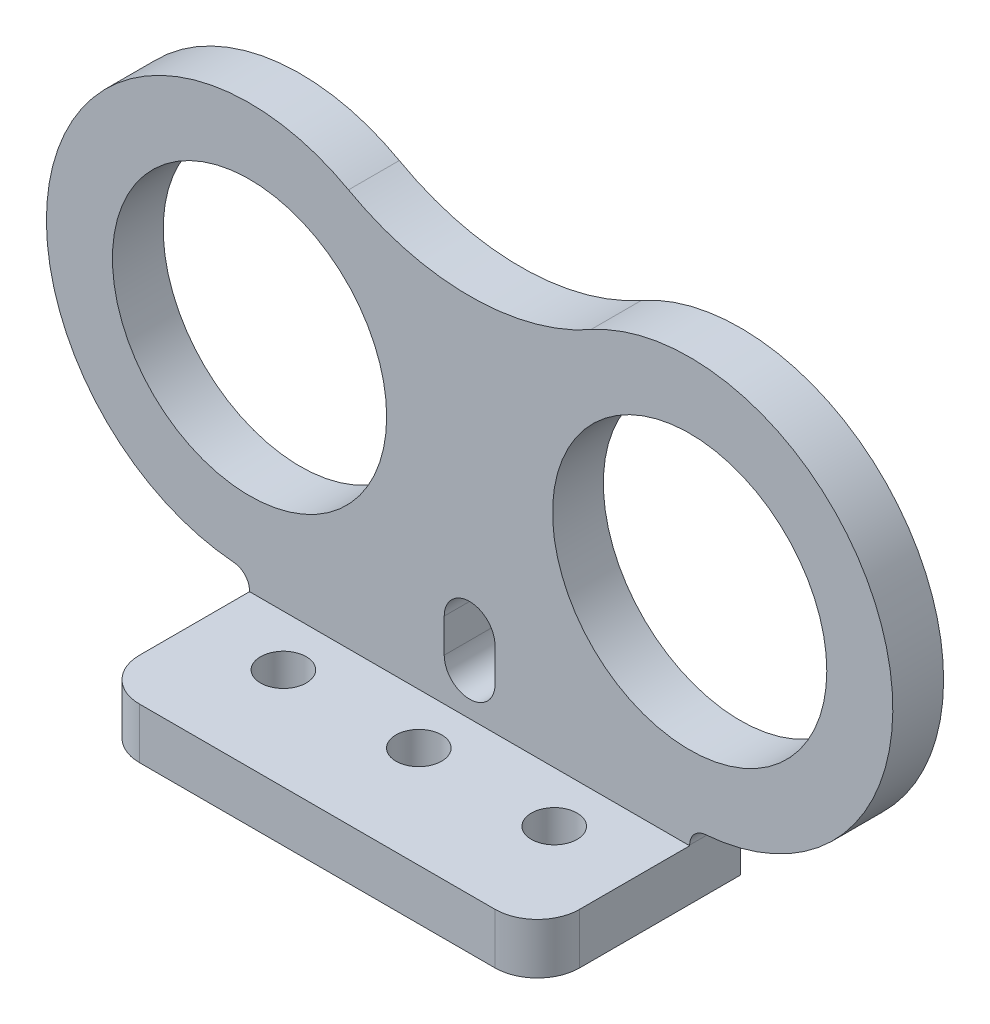
ISO-10303-21;
HEADER;
FILE_DESCRIPTION(('STEP AP214'),'2;1');
FILE_NAME('part.step','',(''),(''),'','','');
FILE_SCHEMA(('AUTOMOTIVE_DESIGN { 1 0 10303 214 1 1 1 1 }'));
ENDSEC;
DATA;
#1=APPLICATION_CONTEXT('core data for automotive mechanical design processes');
#2=APPLICATION_PROTOCOL_DEFINITION('international standard','automotive_design',2000,#1);
#3=PRODUCT_CONTEXT('',#1,'mechanical');
#4=PRODUCT('Part','Part','',(#3));
#5=PRODUCT_RELATED_PRODUCT_CATEGORY('part','',(#4));
#6=PRODUCT_DEFINITION_FORMATION('','',#4);
#7=PRODUCT_DEFINITION_CONTEXT('part definition',#1,'design');
#8=PRODUCT_DEFINITION('design','',#6,#7);
#9=PRODUCT_DEFINITION_SHAPE('','',#8);
#10=(LENGTH_UNIT() NAMED_UNIT(*) SI_UNIT(.MILLI.,.METRE.));
#11=(NAMED_UNIT(*) PLANE_ANGLE_UNIT() SI_UNIT($,.RADIAN.));
#12=(NAMED_UNIT(*) SI_UNIT($,.STERADIAN.) SOLID_ANGLE_UNIT());
#13=UNCERTAINTY_MEASURE_WITH_UNIT(LENGTH_MEASURE(1.E-05),#10,'distance_accuracy_value','');
#14=(GEOMETRIC_REPRESENTATION_CONTEXT(3) GLOBAL_UNCERTAINTY_ASSIGNED_CONTEXT((#13)) GLOBAL_UNIT_ASSIGNED_CONTEXT((#10,
#11,#12)) REPRESENTATION_CONTEXT('',''));
#15=CARTESIAN_POINT('',(0.,0.,0.));
#16=DIRECTION('',(0.,0.,1.));
#17=DIRECTION('',(1.,0.,0.));
#18=AXIS2_PLACEMENT_3D('',#15,#16,#17);
#19=CARTESIAN_POINT('',(0.,0.,3.));
#20=DIRECTION('',(0.,0.,1.));
#21=DIRECTION('',(1.,0.,0.));
#22=AXIS2_PLACEMENT_3D('',#19,#20,#21);
#23=PLANE('',#22);
#24=CARTESIAN_POINT('',(0.,5.5,3.));
#25=DIRECTION('',(0.,0.,1.));
#26=DIRECTION('',(1.,0.,0.));
#27=AXIS2_PLACEMENT_3D('',#24,#25,#26);
#28=CIRCLE('',#27,1.5);
#29=CARTESIAN_POINT('',(-1.5,5.5,3.));
#30=VERTEX_POINT('',#29);
#31=CARTESIAN_POINT('',(1.5,5.5,3.));
#32=VERTEX_POINT('',#31);
#33=EDGE_CURVE('E245',#30,#32,#28,.T.);
#34=ORIENTED_EDGE('',*,*,#33,.F.);
#35=DIRECTION('',(0.,-1.,0.));
#36=VECTOR('',#35,1.);
#37=CARTESIAN_POINT('',(-1.5,0.,3.));
#38=LINE('',#37,#36);
#39=CARTESIAN_POINT('',(-1.5,7.5,3.));
#40=VERTEX_POINT('',#39);
#41=EDGE_CURVE('E276',#40,#30,#38,.T.);
#42=ORIENTED_EDGE('',*,*,#41,.F.);
#43=CARTESIAN_POINT('',(0.,7.5,3.));
#44=DIRECTION('',(0.,0.,1.));
#45=DIRECTION('',(1.,0.,0.));
#46=AXIS2_PLACEMENT_3D('',#43,#44,#45);
#47=CIRCLE('',#46,1.5);
#48=CARTESIAN_POINT('',(1.5,7.5,3.));
#49=VERTEX_POINT('',#48);
#50=EDGE_CURVE('E285',#49,#40,#47,.T.);
#51=ORIENTED_EDGE('',*,*,#50,.F.);
#52=DIRECTION('',(0.,-1.,0.));
#53=VECTOR('',#52,1.);
#54=CARTESIAN_POINT('',(1.5,0.,3.));
#55=LINE('',#54,#53);
#56=EDGE_CURVE('E287',#49,#32,#55,.T.);
#57=ORIENTED_EDGE('',*,*,#56,.T.);
#58=EDGE_LOOP('',(#34,#42,#51,#57));
#59=FACE_BOUND('',#58,.T.);
#60=CARTESIAN_POINT('',(13.,16.,3.));
#61=DIRECTION('',(0.,0.,1.));
#62=DIRECTION('',(1.,0.,0.));
#63=AXIS2_PLACEMENT_3D('',#60,#61,#62);
#64=CIRCLE('',#63,8.10000000000002);
#65=CARTESIAN_POINT('',(21.1,16.,3.));
#66=VERTEX_POINT('',#65);
#67=EDGE_CURVE('E183',#66,#66,#64,.T.);
#68=ORIENTED_EDGE('',*,*,#67,.F.);
#69=EDGE_LOOP('',(#68));
#70=FACE_BOUND('',#69,.T.);
#71=CARTESIAN_POINT('',(-13.,16.,3.));
#72=DIRECTION('',(0.,0.,1.));
#73=DIRECTION('',(1.,0.,0.));
#74=AXIS2_PLACEMENT_3D('',#71,#72,#73);
#75=CIRCLE('',#74,8.10000000000002);
#76=CARTESIAN_POINT('',(-4.89999999999998,16.,3.));
#77=VERTEX_POINT('',#76);
#78=EDGE_CURVE('E187',#77,#77,#75,.F.);
#79=ORIENTED_EDGE('',*,*,#78,.T.);
#80=EDGE_LOOP('',(#79));
#81=FACE_BOUND('',#80,.T.);
#82=DIRECTION('',(0.,-1.,0.));
#83=VECTOR('',#82,1.);
#84=CARTESIAN_POINT('',(-13.,0.,3.));
#85=LINE('',#84,#83);
#86=CARTESIAN_POINT('',(-13.,3.03851860318428,3.));
#87=VERTEX_POINT('',#86);
#88=CARTESIAN_POINT('',(-13.,3.,3.));
#89=VERTEX_POINT('',#88);
#90=EDGE_CURVE('E165',#87,#89,#85,.T.);
#91=ORIENTED_EDGE('',*,*,#90,.T.);
#92=DIRECTION('',(1.,0.,0.));
#93=VECTOR('',#92,1.);
#94=CARTESIAN_POINT('',(-13.,3.,3.));
#95=LINE('',#94,#93);
#96=CARTESIAN_POINT('',(13.,3.,3.));
#97=VERTEX_POINT('',#96);
#98=EDGE_CURVE('E320',#89,#97,#95,.T.);
#99=ORIENTED_EDGE('',*,*,#98,.T.);
#100=DIRECTION('',(0.,-1.,0.));
#101=VECTOR('',#100,1.);
#102=CARTESIAN_POINT('',(13.,0.,3.));
#103=LINE('',#102,#101);
#104=CARTESIAN_POINT('',(13.,3.03851860318428,3.));
#105=VERTEX_POINT('',#104);
#106=EDGE_CURVE('E180',#105,#97,#103,.T.);
#107=ORIENTED_EDGE('',*,*,#106,.F.);
#108=CARTESIAN_POINT('',(14.,3.03851860318428,3.));
#109=DIRECTION('',(0.,0.,1.));
#110=DIRECTION('',(1.,0.,0.));
#111=AXIS2_PLACEMENT_3D('',#108,#109,#110);
#112=CIRCLE('',#111,1.);
#113=CARTESIAN_POINT('',(13.9230769230769,4.03555563370856,3.));
#114=VERTEX_POINT('',#113);
#115=EDGE_CURVE('E291',#114,#105,#112,.T.);
#116=ORIENTED_EDGE('',*,*,#115,.F.);
#117=CARTESIAN_POINT('',(13.,16.,3.));
#118=DIRECTION('',(0.,0.,1.));
#119=DIRECTION('',(1.,0.,0.));
#120=AXIS2_PLACEMENT_3D('',#117,#118,#119);
#121=CIRCLE('',#120,12.);
#122=CARTESIAN_POINT('',(7.1533537155293,26.4793476526111,3.));
#123=VERTEX_POINT('',#122);
#124=EDGE_CURVE('E174',#123,#114,#121,.F.);
#125=ORIENTED_EDGE('',*,*,#124,.F.);
#126=CARTESIAN_POINT('',(0.,39.3007972187045,3.));
#127=DIRECTION('',(0.,0.,1.));
#128=DIRECTION('',(1.,0.,0.));
#129=AXIS2_PLACEMENT_3D('',#126,#127,#128);
#130=CIRCLE('',#129,14.681963027993);
#131=CARTESIAN_POINT('',(-7.1533537155293,26.4793476526111,3.));
#132=VERTEX_POINT('',#131);
#133=EDGE_CURVE('E170',#132,#123,#130,.T.);
#134=ORIENTED_EDGE('',*,*,#133,.F.);
#135=CARTESIAN_POINT('',(-13.,16.,3.));
#136=DIRECTION('',(0.,0.,1.));
#137=DIRECTION('',(1.,0.,0.));
#138=AXIS2_PLACEMENT_3D('',#135,#136,#137);
#139=CIRCLE('',#138,12.);
#140=CARTESIAN_POINT('',(-13.9230769230769,4.03555563370856,3.));
#141=VERTEX_POINT('',#140);
#142=EDGE_CURVE('E147',#141,#132,#139,.F.);
#143=ORIENTED_EDGE('',*,*,#142,.F.);
#144=CARTESIAN_POINT('',(-14.,3.03851860318428,3.));
#145=DIRECTION('',(0.,0.,1.));
#146=DIRECTION('',(1.,0.,0.));
#147=AXIS2_PLACEMENT_3D('',#144,#145,#146);
#148=CIRCLE('',#147,1.);
#149=EDGE_CURVE('E159',#141,#87,#148,.F.);
#150=ORIENTED_EDGE('',*,*,#149,.T.);
#151=EDGE_LOOP('',(#91,#99,#107,#116,#125,#134,#143,#150));
#152=FACE_BOUND('',#151,.T.);
#153=ADVANCED_FACE('F41',(#59,#70,#81,#152),#23,.T.);
#154=CARTESIAN_POINT('',(14.,3.03851860318428,3.));
#155=DIRECTION('',(0.,0.,-1.));
#156=DIRECTION('',(-1.,0.,0.));
#157=AXIS2_PLACEMENT_3D('',#154,#155,#156);
#158=CYLINDRICAL_SURFACE('',#157,1.);
#159=CARTESIAN_POINT('',(14.,3.03851860318428,0.));
#160=DIRECTION('',(0.,0.,1.));
#161=DIRECTION('',(1.,0.,0.));
#162=AXIS2_PLACEMENT_3D('',#159,#160,#161);
#163=CIRCLE('',#162,1.);
#164=CARTESIAN_POINT('',(13.9230769230769,4.03555563370856,0.));
#165=VERTEX_POINT('',#164);
#166=CARTESIAN_POINT('',(13.,3.03851860318428,0.));
#167=VERTEX_POINT('',#166);
#168=EDGE_CURVE('E209',#165,#167,#163,.T.);
#169=ORIENTED_EDGE('',*,*,#168,.F.);
#170=DIRECTION('',(0.,0.,-1.));
#171=VECTOR('',#170,1.);
#172=CARTESIAN_POINT('',(13.9230769230769,4.03555563370856,3.));
#173=LINE('',#172,#171);
#174=EDGE_CURVE('E11',#114,#165,#173,.T.);
#175=ORIENTED_EDGE('',*,*,#174,.F.);
#176=ORIENTED_EDGE('',*,*,#115,.T.);
#177=DIRECTION('',(0.,0.,-1.));
#178=VECTOR('',#177,1.);
#179=CARTESIAN_POINT('',(13.,3.03851860318428,3.));
#180=LINE('',#179,#178);
#181=EDGE_CURVE('E68',#105,#167,#180,.T.);
#182=ORIENTED_EDGE('',*,*,#181,.T.);
#183=EDGE_LOOP('',(#169,#175,#176,#182));
#184=FACE_BOUND('',#183,.T.);
#185=ADVANCED_FACE('F453',(#184),#158,.F.);
#186=CARTESIAN_POINT('',(13.,16.,3.));
#187=DIRECTION('',(0.,0.,-1.));
#188=DIRECTION('',(-1.,0.,0.));
#189=AXIS2_PLACEMENT_3D('',#186,#187,#188);
#190=CYLINDRICAL_SURFACE('',#189,12.);
#191=CARTESIAN_POINT('',(13.,16.,0.));
#192=DIRECTION('',(0.,0.,1.));
#193=DIRECTION('',(1.,0.,0.));
#194=AXIS2_PLACEMENT_3D('',#191,#192,#193);
#195=CIRCLE('',#194,12.);
#196=CARTESIAN_POINT('',(7.1533537155293,26.4793476526111,0.));
#197=VERTEX_POINT('',#196);
#198=EDGE_CURVE('E212',#197,#165,#195,.F.);
#199=ORIENTED_EDGE('',*,*,#198,.F.);
#200=DIRECTION('',(0.,0.,-1.));
#201=VECTOR('',#200,1.);
#202=CARTESIAN_POINT('',(7.1533537155293,26.4793476526111,3.));
#203=LINE('',#202,#201);
#204=EDGE_CURVE('E51',#123,#197,#203,.T.);
#205=ORIENTED_EDGE('',*,*,#204,.F.);
#206=ORIENTED_EDGE('',*,*,#124,.T.);
#207=ORIENTED_EDGE('',*,*,#174,.T.);
#208=EDGE_LOOP('',(#199,#205,#206,#207));
#209=FACE_BOUND('',#208,.T.);
#210=ADVANCED_FACE('F305',(#209),#190,.T.);
#211=CARTESIAN_POINT('',(0.,39.3007972187045,3.));
#212=DIRECTION('',(0.,0.,-1.));
#213=DIRECTION('',(-1.,0.,0.));
#214=AXIS2_PLACEMENT_3D('',#211,#212,#213);
#215=CYLINDRICAL_SURFACE('',#214,14.681963027993);
#216=CARTESIAN_POINT('',(0.,39.3007972187045,0.));
#217=DIRECTION('',(0.,0.,1.));
#218=DIRECTION('',(1.,0.,0.));
#219=AXIS2_PLACEMENT_3D('',#216,#217,#218);
#220=CIRCLE('',#219,14.681963027993);
#221=CARTESIAN_POINT('',(-7.1533537155293,26.4793476526111,0.));
#222=VERTEX_POINT('',#221);
#223=EDGE_CURVE('E216',#222,#197,#220,.T.);
#224=ORIENTED_EDGE('',*,*,#223,.F.);
#225=DIRECTION('',(0.,0.,-1.));
#226=VECTOR('',#225,1.);
#227=CARTESIAN_POINT('',(-7.1533537155293,26.4793476526111,3.));
#228=LINE('',#227,#226);
#229=EDGE_CURVE('E154',#132,#222,#228,.T.);
#230=ORIENTED_EDGE('',*,*,#229,.F.);
#231=ORIENTED_EDGE('',*,*,#133,.T.);
#232=ORIENTED_EDGE('',*,*,#204,.T.);
#233=EDGE_LOOP('',(#224,#230,#231,#232));
#234=FACE_BOUND('',#233,.T.);
#235=ADVANCED_FACE('F310',(#234),#215,.F.);
#236=CARTESIAN_POINT('',(-13.,16.,3.));
#237=DIRECTION('',(0.,0.,-1.));
#238=DIRECTION('',(-1.,0.,0.));
#239=AXIS2_PLACEMENT_3D('',#236,#237,#238);
#240=CYLINDRICAL_SURFACE('',#239,12.);
#241=CARTESIAN_POINT('',(-13.,16.,0.));
#242=DIRECTION('',(0.,0.,1.));
#243=DIRECTION('',(1.,0.,0.));
#244=AXIS2_PLACEMENT_3D('',#241,#242,#243);
#245=CIRCLE('',#244,12.);
#246=CARTESIAN_POINT('',(-13.9230769230769,4.03555563370856,0.));
#247=VERTEX_POINT('',#246);
#248=EDGE_CURVE('E149',#247,#222,#245,.F.);
#249=ORIENTED_EDGE('',*,*,#248,.F.);
#250=DIRECTION('',(0.,0.,-1.));
#251=VECTOR('',#250,1.);
#252=CARTESIAN_POINT('',(-13.9230769230769,4.03555563370856,3.));
#253=LINE('',#252,#251);
#254=EDGE_CURVE('E143',#141,#247,#253,.T.);
#255=ORIENTED_EDGE('',*,*,#254,.F.);
#256=ORIENTED_EDGE('',*,*,#142,.T.);
#257=ORIENTED_EDGE('',*,*,#229,.T.);
#258=EDGE_LOOP('',(#249,#255,#256,#257));
#259=FACE_BOUND('',#258,.T.);
#260=ADVANCED_FACE('F145',(#259),#240,.T.);
#261=CARTESIAN_POINT('',(-14.,3.03851860318428,3.));
#262=DIRECTION('',(0.,0.,-1.));
#263=DIRECTION('',(-1.,0.,0.));
#264=AXIS2_PLACEMENT_3D('',#261,#262,#263);
#265=CYLINDRICAL_SURFACE('',#264,1.);
#266=CARTESIAN_POINT('',(-14.,3.03851860318428,0.));
#267=DIRECTION('',(0.,0.,1.));
#268=DIRECTION('',(1.,0.,0.));
#269=AXIS2_PLACEMENT_3D('',#266,#267,#268);
#270=CIRCLE('',#269,1.);
#271=CARTESIAN_POINT('',(-13.,3.03851860318428,0.));
#272=VERTEX_POINT('',#271);
#273=EDGE_CURVE('E222',#247,#272,#270,.F.);
#274=ORIENTED_EDGE('',*,*,#273,.T.);
#275=DIRECTION('',(0.,0.,-1.));
#276=VECTOR('',#275,1.);
#277=CARTESIAN_POINT('',(-13.,3.03851860318428,3.));
#278=LINE('',#277,#276);
#279=EDGE_CURVE('E155',#87,#272,#278,.T.);
#280=ORIENTED_EDGE('',*,*,#279,.F.);
#281=ORIENTED_EDGE('',*,*,#149,.F.);
#282=ORIENTED_EDGE('',*,*,#254,.T.);
#283=EDGE_LOOP('',(#274,#280,#281,#282));
#284=FACE_BOUND('',#283,.T.);
#285=ADVANCED_FACE('F160',(#284),#265,.F.);
#286=CARTESIAN_POINT('',(-13.,0.,3.));
#287=DIRECTION('',(1.,0.,0.));
#288=DIRECTION('',(0.,0.,-1.));
#289=AXIS2_PLACEMENT_3D('',#286,#287,#288);
#290=PLANE('',#289);
#291=DIRECTION('',(0.,-1.,0.));
#292=VECTOR('',#291,1.);
#293=CARTESIAN_POINT('',(-13.,0.,0.));
#294=LINE('',#293,#292);
#295=CARTESIAN_POINT('',(-13.,0.,0.));
#296=VERTEX_POINT('',#295);
#297=EDGE_CURVE('E225',#272,#296,#294,.T.);
#298=ORIENTED_EDGE('',*,*,#297,.T.);
#299=DIRECTION('',(0.,0.,-1.));
#300=VECTOR('',#299,1.);
#301=CARTESIAN_POINT('',(-13.,0.,3.));
#302=LINE('',#301,#300);
#303=CARTESIAN_POINT('',(-13.,0.,9.49999999999998));
#304=VERTEX_POINT('',#303);
#305=EDGE_CURVE('E251',#304,#296,#302,.T.);
#306=ORIENTED_EDGE('',*,*,#305,.F.);
#307=DIRECTION('',(0.,-1.,0.));
#308=VECTOR('',#307,1.);
#309=CARTESIAN_POINT('',(-13.,3.,9.49999999999998));
#310=LINE('',#309,#308);
#311=CARTESIAN_POINT('',(-13.,3.,9.49999999999998));
#312=VERTEX_POINT('',#311);
#313=EDGE_CURVE('E197',#312,#304,#310,.T.);
#314=ORIENTED_EDGE('',*,*,#313,.F.);
#315=DIRECTION('',(0.,0.,-1.));
#316=VECTOR('',#315,1.);
#317=CARTESIAN_POINT('',(-13.,3.,3.));
#318=LINE('',#317,#316);
#319=EDGE_CURVE('E319',#312,#89,#318,.T.);
#320=ORIENTED_EDGE('',*,*,#319,.T.);
#321=ORIENTED_EDGE('',*,*,#90,.F.);
#322=ORIENTED_EDGE('',*,*,#279,.T.);
#323=EDGE_LOOP('',(#298,#306,#314,#320,#321,#322));
#324=FACE_BOUND('',#323,.T.);
#325=ADVANCED_FACE('F314',(#324),#290,.F.);
#326=CARTESIAN_POINT('',(0.,0.,3.));
#327=DIRECTION('',(0.,1.,0.));
#328=DIRECTION('',(-1.,0.,0.));
#329=AXIS2_PLACEMENT_3D('',#326,#327,#328);
#330=PLANE('',#329);
#331=DIRECTION('',(1.,0.,0.));
#332=VECTOR('',#331,1.);
#333=CARTESIAN_POINT('',(0.,0.,0.));
#334=LINE('',#333,#332);
#335=CARTESIAN_POINT('',(13.,0.,0.));
#336=VERTEX_POINT('',#335);
#337=EDGE_CURVE('E229',#296,#336,#334,.T.);
#338=ORIENTED_EDGE('',*,*,#337,.T.);
#339=DIRECTION('',(0.,0.,-1.));
#340=VECTOR('',#339,1.);
#341=CARTESIAN_POINT('',(13.,0.,3.));
#342=LINE('',#341,#340);
#343=CARTESIAN_POINT('',(13.,0.,9.49999999999998));
#344=VERTEX_POINT('',#343);
#345=EDGE_CURVE('E248',#344,#336,#342,.T.);
#346=ORIENTED_EDGE('',*,*,#345,.F.);
#347=CARTESIAN_POINT('',(10.5,0.,9.5));
#348=DIRECTION('',(0.,-1.,0.));
#349=DIRECTION('',(-1.,0.,0.));
#350=AXIS2_PLACEMENT_3D('',#347,#348,#349);
#351=CIRCLE('',#350,2.5);
#352=CARTESIAN_POINT('',(10.5,0.,12.));
#353=VERTEX_POINT('',#352);
#354=EDGE_CURVE('E363',#344,#353,#351,.T.);
#355=ORIENTED_EDGE('',*,*,#354,.T.);
#356=DIRECTION('',(-1.,0.,0.));
#357=VECTOR('',#356,1.);
#358=CARTESIAN_POINT('',(-10.5,0.,12.));
#359=LINE('',#358,#357);
#360=CARTESIAN_POINT('',(-10.5,0.,12.));
#361=VERTEX_POINT('',#360);
#362=EDGE_CURVE('E346',#353,#361,#359,.T.);
#363=ORIENTED_EDGE('',*,*,#362,.T.);
#364=CARTESIAN_POINT('',(-10.5,0.,9.5));
#365=DIRECTION('',(0.,-1.,0.));
#366=DIRECTION('',(-1.,0.,0.));
#367=AXIS2_PLACEMENT_3D('',#364,#365,#366);
#368=CIRCLE('',#367,2.5);
#369=EDGE_CURVE('E361',#361,#304,#368,.T.);
#370=ORIENTED_EDGE('',*,*,#369,.T.);
#371=ORIENTED_EDGE('',*,*,#305,.T.);
#372=EDGE_LOOP('',(#338,#346,#355,#363,#370,#371));
#373=FACE_BOUND('',#372,.T.);
#374=CARTESIAN_POINT('',(0.,0.,6.));
#375=DIRECTION('',(0.,-1.,0.));
#376=DIRECTION('',(1.,0.,0.));
#377=AXIS2_PLACEMENT_3D('',#374,#375,#376);
#378=CIRCLE('',#377,1.35);
#379=CARTESIAN_POINT('',(1.35,0.,6.));
#380=VERTEX_POINT('',#379);
#381=EDGE_CURVE('E416',#380,#380,#378,.T.);
#382=ORIENTED_EDGE('',*,*,#381,.F.);
#383=EDGE_LOOP('',(#382));
#384=FACE_BOUND('',#383,.T.);
#385=CARTESIAN_POINT('',(-8.,0.,6.));
#386=DIRECTION('',(0.,-1.,0.));
#387=DIRECTION('',(-1.,0.,0.));
#388=AXIS2_PLACEMENT_3D('',#385,#386,#387);
#389=CIRCLE('',#388,1.35);
#390=CARTESIAN_POINT('',(-9.35,0.,6.));
#391=VERTEX_POINT('',#390);
#392=EDGE_CURVE('E408',#391,#391,#389,.T.);
#393=ORIENTED_EDGE('',*,*,#392,.F.);
#394=EDGE_LOOP('',(#393));
#395=FACE_BOUND('',#394,.T.);
#396=CARTESIAN_POINT('',(8.,0.,6.));
#397=DIRECTION('',(0.,-1.,0.));
#398=DIRECTION('',(1.,0.,0.));
#399=AXIS2_PLACEMENT_3D('',#396,#397,#398);
#400=CIRCLE('',#399,1.35);
#401=CARTESIAN_POINT('',(9.35,0.,6.));
#402=VERTEX_POINT('',#401);
#403=EDGE_CURVE('E400',#402,#402,#400,.T.);
#404=ORIENTED_EDGE('',*,*,#403,.F.);
#405=EDGE_LOOP('',(#404));
#406=FACE_BOUND('',#405,.T.);
#407=ADVANCED_FACE('F359',(#373,#384,#395,#406),#330,.F.);
#408=CARTESIAN_POINT('',(0.,5.5,3.));
#409=DIRECTION('',(0.,0.,-1.));
#410=DIRECTION('',(-1.,0.,0.));
#411=AXIS2_PLACEMENT_3D('',#408,#409,#410);
#412=CYLINDRICAL_SURFACE('',#411,1.5);
#413=CARTESIAN_POINT('',(0.,5.5,0.));
#414=DIRECTION('',(0.,0.,1.));
#415=DIRECTION('',(1.,0.,0.));
#416=AXIS2_PLACEMENT_3D('',#413,#414,#415);
#417=CIRCLE('',#416,1.5);
#418=CARTESIAN_POINT('',(-1.5,5.5,0.));
#419=VERTEX_POINT('',#418);
#420=CARTESIAN_POINT('',(1.5,5.5,0.));
#421=VERTEX_POINT('',#420);
#422=EDGE_CURVE('E192',#419,#421,#417,.T.);
#423=ORIENTED_EDGE('',*,*,#422,.F.);
#424=DIRECTION('',(0.,0.,-1.));
#425=VECTOR('',#424,1.);
#426=CARTESIAN_POINT('',(-1.5,5.5,3.));
#427=LINE('',#426,#425);
#428=EDGE_CURVE('E45',#30,#419,#427,.T.);
#429=ORIENTED_EDGE('',*,*,#428,.F.);
#430=ORIENTED_EDGE('',*,*,#33,.T.);
#431=DIRECTION('',(0.,0.,-1.));
#432=VECTOR('',#431,1.);
#433=CARTESIAN_POINT('',(1.5,5.5,3.));
#434=LINE('',#433,#432);
#435=EDGE_CURVE('E191',#32,#421,#434,.T.);
#436=ORIENTED_EDGE('',*,*,#435,.T.);
#437=EDGE_LOOP('',(#423,#429,#430,#436));
#438=FACE_BOUND('',#437,.T.);
#439=ADVANCED_FACE('F43',(#438),#412,.F.);
#440=CARTESIAN_POINT('',(-1.5,0.,3.));
#441=DIRECTION('',(1.,0.,0.));
#442=DIRECTION('',(0.,1.,0.));
#443=AXIS2_PLACEMENT_3D('',#440,#441,#442);
#444=PLANE('',#443);
#445=DIRECTION('',(0.,-1.,0.));
#446=VECTOR('',#445,1.);
#447=CARTESIAN_POINT('',(-1.5,0.,0.));
#448=LINE('',#447,#446);
#449=CARTESIAN_POINT('',(-1.5,7.5,0.));
#450=VERTEX_POINT('',#449);
#451=EDGE_CURVE('E196',#450,#419,#448,.T.);
#452=ORIENTED_EDGE('',*,*,#451,.F.);
#453=DIRECTION('',(0.,0.,-1.));
#454=VECTOR('',#453,1.);
#455=CARTESIAN_POINT('',(-1.5,7.5,3.));
#456=LINE('',#455,#454);
#457=EDGE_CURVE('E265',#40,#450,#456,.T.);
#458=ORIENTED_EDGE('',*,*,#457,.F.);
#459=ORIENTED_EDGE('',*,*,#41,.T.);
#460=ORIENTED_EDGE('',*,*,#428,.T.);
#461=EDGE_LOOP('',(#452,#458,#459,#460));
#462=FACE_BOUND('',#461,.T.);
#463=ADVANCED_FACE('F274',(#462),#444,.T.);
#464=CARTESIAN_POINT('',(0.,7.5,3.));
#465=DIRECTION('',(0.,0.,-1.));
#466=DIRECTION('',(-1.,0.,0.));
#467=AXIS2_PLACEMENT_3D('',#464,#465,#466);
#468=CYLINDRICAL_SURFACE('',#467,1.5);
#469=CARTESIAN_POINT('',(0.,7.5,0.));
#470=DIRECTION('',(0.,0.,1.));
#471=DIRECTION('',(1.,0.,0.));
#472=AXIS2_PLACEMENT_3D('',#469,#470,#471);
#473=CIRCLE('',#472,1.5);
#474=CARTESIAN_POINT('',(1.5,7.5,0.));
#475=VERTEX_POINT('',#474);
#476=EDGE_CURVE('E201',#475,#450,#473,.T.);
#477=ORIENTED_EDGE('',*,*,#476,.F.);
#478=DIRECTION('',(0.,0.,-1.));
#479=VECTOR('',#478,1.);
#480=CARTESIAN_POINT('',(1.5,7.5,3.));
#481=LINE('',#480,#479);
#482=EDGE_CURVE('E263',#49,#475,#481,.T.);
#483=ORIENTED_EDGE('',*,*,#482,.F.);
#484=ORIENTED_EDGE('',*,*,#50,.T.);
#485=ORIENTED_EDGE('',*,*,#457,.T.);
#486=EDGE_LOOP('',(#477,#483,#484,#485));
#487=FACE_BOUND('',#486,.T.);
#488=ADVANCED_FACE('F282',(#487),#468,.F.);
#489=CARTESIAN_POINT('',(13.,16.,3.));
#490=DIRECTION('',(0.,0.,-1.));
#491=DIRECTION('',(-1.,0.,0.));
#492=AXIS2_PLACEMENT_3D('',#489,#490,#491);
#493=CYLINDRICAL_SURFACE('',#492,8.10000000000002);
#494=ORIENTED_EDGE('',*,*,#67,.T.);
#495=EDGE_LOOP('',(#494));
#496=FACE_BOUND('',#495,.T.);
#497=CARTESIAN_POINT('',(13.,16.,0.));
#498=DIRECTION('',(0.,0.,1.));
#499=DIRECTION('',(1.,0.,0.));
#500=AXIS2_PLACEMENT_3D('',#497,#498,#499);
#501=CIRCLE('',#500,8.10000000000002);
#502=CARTESIAN_POINT('',(21.1,16.,0.));
#503=VERTEX_POINT('',#502);
#504=EDGE_CURVE('E237',#503,#503,#501,.T.);
#505=ORIENTED_EDGE('',*,*,#504,.F.);
#506=EDGE_LOOP('',(#505));
#507=FACE_BOUND('',#506,.T.);
#508=ADVANCED_FACE('F468',(#496,#507),#493,.F.);
#509=CARTESIAN_POINT('',(13.,0.,3.));
#510=DIRECTION('',(1.,0.,0.));
#511=DIRECTION('',(0.,0.,-1.));
#512=AXIS2_PLACEMENT_3D('',#509,#510,#511);
#513=PLANE('',#512);
#514=DIRECTION('',(0.,-1.,0.));
#515=VECTOR('',#514,1.);
#516=CARTESIAN_POINT('',(13.,0.,0.));
#517=LINE('',#516,#515);
#518=EDGE_CURVE('E233',#167,#336,#517,.T.);
#519=ORIENTED_EDGE('',*,*,#518,.F.);
#520=ORIENTED_EDGE('',*,*,#181,.F.);
#521=ORIENTED_EDGE('',*,*,#106,.T.);
#522=DIRECTION('',(0.,0.,1.));
#523=VECTOR('',#522,1.);
#524=CARTESIAN_POINT('',(13.,3.,3.));
#525=LINE('',#524,#523);
#526=CARTESIAN_POINT('',(13.,3.,9.49999999999998));
#527=VERTEX_POINT('',#526);
#528=EDGE_CURVE('E59',#97,#527,#525,.T.);
#529=ORIENTED_EDGE('',*,*,#528,.T.);
#530=DIRECTION('',(0.,-1.,0.));
#531=VECTOR('',#530,1.);
#532=CARTESIAN_POINT('',(13.,3.,9.49999999999998));
#533=LINE('',#532,#531);
#534=EDGE_CURVE('E378',#527,#344,#533,.T.);
#535=ORIENTED_EDGE('',*,*,#534,.T.);
#536=ORIENTED_EDGE('',*,*,#345,.T.);
#537=EDGE_LOOP('',(#519,#520,#521,#529,#535,#536));
#538=FACE_BOUND('',#537,.T.);
#539=ADVANCED_FACE('F471',(#538),#513,.T.);
#540=CARTESIAN_POINT('',(1.5,0.,3.));
#541=DIRECTION('',(1.,0.,0.));
#542=DIRECTION('',(0.,1.,0.));
#543=AXIS2_PLACEMENT_3D('',#540,#541,#542);
#544=PLANE('',#543);
#545=DIRECTION('',(0.,-1.,0.));
#546=VECTOR('',#545,1.);
#547=CARTESIAN_POINT('',(1.5,0.,0.));
#548=LINE('',#547,#546);
#549=EDGE_CURVE('E205',#475,#421,#548,.T.);
#550=ORIENTED_EDGE('',*,*,#549,.T.);
#551=ORIENTED_EDGE('',*,*,#435,.F.);
#552=ORIENTED_EDGE('',*,*,#56,.F.);
#553=ORIENTED_EDGE('',*,*,#482,.T.);
#554=EDGE_LOOP('',(#550,#551,#552,#553));
#555=FACE_BOUND('',#554,.T.);
#556=ADVANCED_FACE('F288',(#555),#544,.F.);
#557=CARTESIAN_POINT('',(-13.,16.,3.));
#558=DIRECTION('',(0.,0.,-1.));
#559=DIRECTION('',(-1.,0.,0.));
#560=AXIS2_PLACEMENT_3D('',#557,#558,#559);
#561=CYLINDRICAL_SURFACE('',#560,8.10000000000002);
#562=ORIENTED_EDGE('',*,*,#78,.F.);
#563=EDGE_LOOP('',(#562));
#564=FACE_BOUND('',#563,.T.);
#565=CARTESIAN_POINT('',(-13.,16.,0.));
#566=DIRECTION('',(0.,0.,1.));
#567=DIRECTION('',(1.,0.,0.));
#568=AXIS2_PLACEMENT_3D('',#565,#566,#567);
#569=CIRCLE('',#568,8.10000000000002);
#570=CARTESIAN_POINT('',(-4.89999999999998,16.,0.));
#571=VERTEX_POINT('',#570);
#572=EDGE_CURVE('E241',#571,#571,#569,.F.);
#573=ORIENTED_EDGE('',*,*,#572,.T.);
#574=EDGE_LOOP('',(#573));
#575=FACE_BOUND('',#574,.T.);
#576=ADVANCED_FACE('F464',(#564,#575),#561,.F.);
#577=CARTESIAN_POINT('',(0.,0.,0.));
#578=DIRECTION('',(0.,0.,1.));
#579=DIRECTION('',(1.,0.,0.));
#580=AXIS2_PLACEMENT_3D('',#577,#578,#579);
#581=PLANE('',#580);
#582=ORIENTED_EDGE('',*,*,#422,.T.);
#583=ORIENTED_EDGE('',*,*,#549,.F.);
#584=ORIENTED_EDGE('',*,*,#476,.T.);
#585=ORIENTED_EDGE('',*,*,#451,.T.);
#586=EDGE_LOOP('',(#582,#583,#584,#585));
#587=FACE_BOUND('',#586,.T.);
#588=ORIENTED_EDGE('',*,*,#168,.T.);
#589=ORIENTED_EDGE('',*,*,#518,.T.);
#590=ORIENTED_EDGE('',*,*,#337,.F.);
#591=ORIENTED_EDGE('',*,*,#297,.F.);
#592=ORIENTED_EDGE('',*,*,#273,.F.);
#593=ORIENTED_EDGE('',*,*,#248,.T.);
#594=ORIENTED_EDGE('',*,*,#223,.T.);
#595=ORIENTED_EDGE('',*,*,#198,.T.);
#596=EDGE_LOOP('',(#588,#589,#590,#591,#592,#593,#594,#595));
#597=FACE_BOUND('',#596,.T.);
#598=ORIENTED_EDGE('',*,*,#504,.T.);
#599=EDGE_LOOP('',(#598));
#600=FACE_BOUND('',#599,.T.);
#601=ORIENTED_EDGE('',*,*,#572,.F.);
#602=EDGE_LOOP('',(#601));
#603=FACE_BOUND('',#602,.T.);
#604=ADVANCED_FACE('F280',(#587,#597,#600,#603),#581,.F.);
#605=CARTESIAN_POINT('',(-10.5,3.,9.5));
#606=DIRECTION('',(0.,-1.,0.));
#607=DIRECTION('',(1.,0.,0.));
#608=AXIS2_PLACEMENT_3D('',#605,#606,#607);
#609=CYLINDRICAL_SURFACE('',#608,2.5);
#610=ORIENTED_EDGE('',*,*,#369,.F.);
#611=DIRECTION('',(0.,-1.,0.));
#612=VECTOR('',#611,1.);
#613=CARTESIAN_POINT('',(-10.5,3.,12.));
#614=LINE('',#613,#612);
#615=CARTESIAN_POINT('',(-10.5,3.,12.));
#616=VERTEX_POINT('',#615);
#617=EDGE_CURVE('E343',#616,#361,#614,.T.);
#618=ORIENTED_EDGE('',*,*,#617,.F.);
#619=CARTESIAN_POINT('',(-10.5,3.,9.5));
#620=DIRECTION('',(0.,-1.,0.));
#621=DIRECTION('',(-1.,0.,0.));
#622=AXIS2_PLACEMENT_3D('',#619,#620,#621);
#623=CIRCLE('',#622,2.5);
#624=EDGE_CURVE('E381',#616,#312,#623,.T.);
#625=ORIENTED_EDGE('',*,*,#624,.T.);
#626=ORIENTED_EDGE('',*,*,#313,.T.);
#627=EDGE_LOOP('',(#610,#618,#625,#626));
#628=FACE_BOUND('',#627,.T.);
#629=ADVANCED_FACE('F367',(#628),#609,.T.);
#630=CARTESIAN_POINT('',(-10.5,3.,12.));
#631=DIRECTION('',(0.,0.,1.));
#632=DIRECTION('',(1.,0.,0.));
#633=AXIS2_PLACEMENT_3D('',#630,#631,#632);
#634=PLANE('',#633);
#635=ORIENTED_EDGE('',*,*,#362,.F.);
#636=DIRECTION('',(0.,-1.,0.));
#637=VECTOR('',#636,1.);
#638=CARTESIAN_POINT('',(10.5,3.,12.));
#639=LINE('',#638,#637);
#640=CARTESIAN_POINT('',(10.5,3.,12.));
#641=VERTEX_POINT('',#640);
#642=EDGE_CURVE('E355',#641,#353,#639,.T.);
#643=ORIENTED_EDGE('',*,*,#642,.F.);
#644=DIRECTION('',(-1.,0.,0.));
#645=VECTOR('',#644,1.);
#646=CARTESIAN_POINT('',(-10.5,3.,12.));
#647=LINE('',#646,#645);
#648=EDGE_CURVE('E349',#641,#616,#647,.T.);
#649=ORIENTED_EDGE('',*,*,#648,.T.);
#650=ORIENTED_EDGE('',*,*,#617,.T.);
#651=EDGE_LOOP('',(#635,#643,#649,#650));
#652=FACE_BOUND('',#651,.T.);
#653=ADVANCED_FACE('F345',(#652),#634,.T.);
#654=CARTESIAN_POINT('',(10.5,3.,9.5));
#655=DIRECTION('',(0.,-1.,0.));
#656=DIRECTION('',(1.,0.,0.));
#657=AXIS2_PLACEMENT_3D('',#654,#655,#656);
#658=CYLINDRICAL_SURFACE('',#657,2.5);
#659=ORIENTED_EDGE('',*,*,#354,.F.);
#660=ORIENTED_EDGE('',*,*,#534,.F.);
#661=CARTESIAN_POINT('',(10.5,3.,9.5));
#662=DIRECTION('',(0.,-1.,0.));
#663=DIRECTION('',(-1.,0.,0.));
#664=AXIS2_PLACEMENT_3D('',#661,#662,#663);
#665=CIRCLE('',#664,2.5);
#666=EDGE_CURVE('E387',#527,#641,#665,.T.);
#667=ORIENTED_EDGE('',*,*,#666,.T.);
#668=ORIENTED_EDGE('',*,*,#642,.T.);
#669=EDGE_LOOP('',(#659,#660,#667,#668));
#670=FACE_BOUND('',#669,.T.);
#671=ADVANCED_FACE('F450',(#670),#658,.T.);
#672=CARTESIAN_POINT('',(-10.5,3.,9.5));
#673=DIRECTION('',(0.,1.,0.));
#674=DIRECTION('',(-1.,0.,0.));
#675=AXIS2_PLACEMENT_3D('',#672,#673,#674);
#676=PLANE('',#675);
#677=CARTESIAN_POINT('',(0.,3.,6.));
#678=DIRECTION('',(0.,-1.,0.));
#679=DIRECTION('',(1.,0.,0.));
#680=AXIS2_PLACEMENT_3D('',#677,#678,#679);
#681=CIRCLE('',#680,1.35);
#682=CARTESIAN_POINT('',(1.35,3.,6.));
#683=VERTEX_POINT('',#682);
#684=EDGE_CURVE('E412',#683,#683,#681,.T.);
#685=ORIENTED_EDGE('',*,*,#684,.T.);
#686=EDGE_LOOP('',(#685));
#687=FACE_BOUND('',#686,.T.);
#688=CARTESIAN_POINT('',(-8.,3.,6.));
#689=DIRECTION('',(0.,-1.,0.));
#690=DIRECTION('',(-1.,0.,0.));
#691=AXIS2_PLACEMENT_3D('',#688,#689,#690);
#692=CIRCLE('',#691,1.35);
#693=CARTESIAN_POINT('',(-9.35,3.,6.));
#694=VERTEX_POINT('',#693);
#695=EDGE_CURVE('E406',#694,#694,#692,.T.);
#696=ORIENTED_EDGE('',*,*,#695,.T.);
#697=EDGE_LOOP('',(#696));
#698=FACE_BOUND('',#697,.T.);
#699=CARTESIAN_POINT('',(8.,3.,6.));
#700=DIRECTION('',(0.,-1.,0.));
#701=DIRECTION('',(1.,0.,0.));
#702=AXIS2_PLACEMENT_3D('',#699,#700,#701);
#703=CIRCLE('',#702,1.35);
#704=CARTESIAN_POINT('',(9.35,3.,6.));
#705=VERTEX_POINT('',#704);
#706=EDGE_CURVE('E397',#705,#705,#703,.T.);
#707=ORIENTED_EDGE('',*,*,#706,.T.);
#708=EDGE_LOOP('',(#707));
#709=FACE_BOUND('',#708,.T.);
#710=ORIENTED_EDGE('',*,*,#319,.F.);
#711=ORIENTED_EDGE('',*,*,#624,.F.);
#712=ORIENTED_EDGE('',*,*,#648,.F.);
#713=ORIENTED_EDGE('',*,*,#666,.F.);
#714=ORIENTED_EDGE('',*,*,#528,.F.);
#715=ORIENTED_EDGE('',*,*,#98,.F.);
#716=EDGE_LOOP('',(#710,#711,#712,#713,#714,#715));
#717=FACE_BOUND('',#716,.T.);
#718=ADVANCED_FACE('F424',(#687,#698,#709,#717),#676,.T.);
#719=CARTESIAN_POINT('',(8.,3.,6.));
#720=DIRECTION('',(0.,-1.,0.));
#721=DIRECTION('',(1.,0.,0.));
#722=AXIS2_PLACEMENT_3D('',#719,#720,#721);
#723=CYLINDRICAL_SURFACE('',#722,1.35);
#724=ORIENTED_EDGE('',*,*,#706,.F.);
#725=EDGE_LOOP('',(#724));
#726=FACE_BOUND('',#725,.T.);
#727=ORIENTED_EDGE('',*,*,#403,.T.);
#728=EDGE_LOOP('',(#727));
#729=FACE_BOUND('',#728,.T.);
#730=ADVANCED_FACE('F440',(#726,#729),#723,.F.);
#731=CARTESIAN_POINT('',(-8.,3.,6.));
#732=DIRECTION('',(0.,-1.,0.));
#733=DIRECTION('',(1.,0.,0.));
#734=AXIS2_PLACEMENT_3D('',#731,#732,#733);
#735=CYLINDRICAL_SURFACE('',#734,1.35);
#736=ORIENTED_EDGE('',*,*,#695,.F.);
#737=EDGE_LOOP('',(#736));
#738=FACE_BOUND('',#737,.T.);
#739=ORIENTED_EDGE('',*,*,#392,.T.);
#740=EDGE_LOOP('',(#739));
#741=FACE_BOUND('',#740,.T.);
#742=ADVANCED_FACE('F430',(#738,#741),#735,.F.);
#743=CARTESIAN_POINT('',(0.,3.,6.));
#744=DIRECTION('',(0.,-1.,0.));
#745=DIRECTION('',(1.,0.,0.));
#746=AXIS2_PLACEMENT_3D('',#743,#744,#745);
#747=CYLINDRICAL_SURFACE('',#746,1.35);
#748=ORIENTED_EDGE('',*,*,#684,.F.);
#749=EDGE_LOOP('',(#748));
#750=FACE_BOUND('',#749,.T.);
#751=ORIENTED_EDGE('',*,*,#381,.T.);
#752=EDGE_LOOP('',(#751));
#753=FACE_BOUND('',#752,.T.);
#754=ADVANCED_FACE('F427',(#750,#753),#747,.F.);
#755=CLOSED_SHELL('',(#153,#185,#210,#235,#260,#285,#325,#407,#439,#463,#488,#508,#539,#556,
#576,#604,#629,#653,#671,#718,#730,#742,#754));
#756=MANIFOLD_SOLID_BREP('B2',#755);
#757=ADVANCED_BREP_SHAPE_REPRESENTATION('',(#18,#756),#14);
#758=SHAPE_DEFINITION_REPRESENTATION(#9,#757);
ENDSEC;
END-ISO-10303-21;
